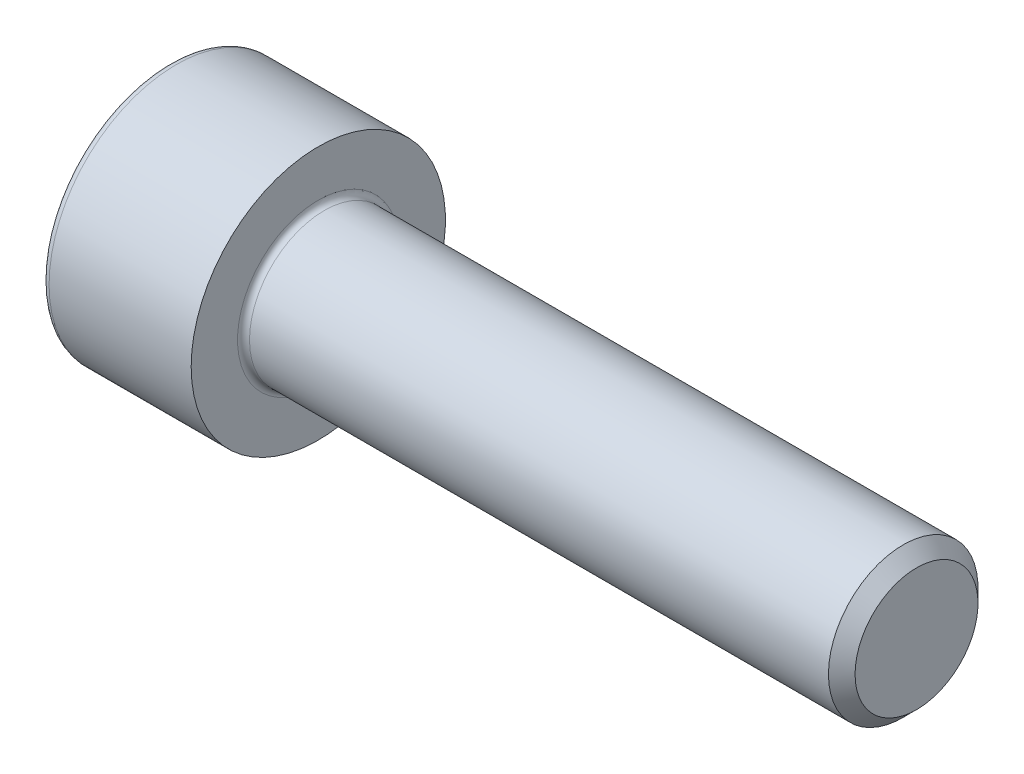
ISO-10303-21;
HEADER;
FILE_DESCRIPTION(('STEP AP214'),'2;1');
FILE_NAME('part.step','',(''),(''),'','','');
FILE_SCHEMA(('AUTOMOTIVE_DESIGN { 1 0 10303 214 1 1 1 1 }'));
ENDSEC;
DATA;
#1=APPLICATION_CONTEXT('core data for automotive mechanical design processes');
#2=APPLICATION_PROTOCOL_DEFINITION('international standard','automotive_design',2000,#1);
#3=PRODUCT_CONTEXT('',#1,'mechanical');
#4=PRODUCT('Part','Part','',(#3));
#5=PRODUCT_RELATED_PRODUCT_CATEGORY('part','',(#4));
#6=PRODUCT_DEFINITION_FORMATION('','',#4);
#7=PRODUCT_DEFINITION_CONTEXT('part definition',#1,'design');
#8=PRODUCT_DEFINITION('design','',#6,#7);
#9=PRODUCT_DEFINITION_SHAPE('','',#8);
#10=(LENGTH_UNIT() NAMED_UNIT(*) SI_UNIT(.MILLI.,.METRE.));
#11=(NAMED_UNIT(*) PLANE_ANGLE_UNIT() SI_UNIT($,.RADIAN.));
#12=(NAMED_UNIT(*) SI_UNIT($,.STERADIAN.) SOLID_ANGLE_UNIT());
#13=UNCERTAINTY_MEASURE_WITH_UNIT(LENGTH_MEASURE(1.E-05),#10,'distance_accuracy_value','');
#14=(GEOMETRIC_REPRESENTATION_CONTEXT(3) GLOBAL_UNCERTAINTY_ASSIGNED_CONTEXT((#13)) GLOBAL_UNIT_ASSIGNED_CONTEXT((#10,
#11,#12)) REPRESENTATION_CONTEXT('',''));
#15=CARTESIAN_POINT('',(0.,0.,0.));
#16=DIRECTION('',(0.,0.,1.));
#17=DIRECTION('',(1.,0.,0.));
#18=AXIS2_PLACEMENT_3D('',#15,#16,#17);
#19=CARTESIAN_POINT('',(0.,0.,0.));
#20=DIRECTION('',(-1.,0.,0.));
#21=DIRECTION('',(0.,0.,1.));
#22=AXIS2_PLACEMENT_3D('',#19,#20,#21);
#23=PLANE('',#22);
#24=DIRECTION('',(0.,-0.499999999999999,0.866025403784439));
#25=VECTOR('',#24,1.);
#26=CARTESIAN_POINT('',(0.,2.35789849937043,0.));
#27=LINE('',#26,#25);
#28=CARTESIAN_POINT('',(0.,2.35789849937043,0.));
#29=VERTEX_POINT('',#28);
#30=CARTESIAN_POINT('',(0.,1.17894924968522,2.042));
#31=VERTEX_POINT('',#30);
#32=EDGE_CURVE('E289',#29,#31,#27,.T.);
#33=ORIENTED_EDGE('',*,*,#32,.T.);
#34=DIRECTION('',(0.,1.,0.));
#35=VECTOR('',#34,1.);
#36=CARTESIAN_POINT('',(0.,-1.17894924968522,2.04200000000001));
#37=LINE('',#36,#35);
#38=CARTESIAN_POINT('',(0.,-1.17894924968522,2.04200000000001));
#39=VERTEX_POINT('',#38);
#40=EDGE_CURVE('E146',#39,#31,#37,.T.);
#41=ORIENTED_EDGE('',*,*,#40,.F.);
#42=DIRECTION('',(0.,-0.500000000000001,-0.866025403784438));
#43=VECTOR('',#42,1.);
#44=CARTESIAN_POINT('',(0.,-1.17894924968522,2.04200000000001));
#45=LINE('',#44,#43);
#46=CARTESIAN_POINT('',(0.,-2.35789849937043,0.));
#47=VERTEX_POINT('',#46);
#48=EDGE_CURVE('E294',#39,#47,#45,.T.);
#49=ORIENTED_EDGE('',*,*,#48,.T.);
#50=DIRECTION('',(0.,0.499999999999999,-0.866025403784439));
#51=VECTOR('',#50,1.);
#52=CARTESIAN_POINT('',(0.,-2.35789849937043,0.));
#53=LINE('',#52,#51);
#54=CARTESIAN_POINT('',(0.,-1.17894924968522,-2.042));
#55=VERTEX_POINT('',#54);
#56=EDGE_CURVE('E298',#47,#55,#53,.T.);
#57=ORIENTED_EDGE('',*,*,#56,.T.);
#58=DIRECTION('',(0.,-1.,0.));
#59=VECTOR('',#58,1.);
#60=CARTESIAN_POINT('',(0.,1.17894924968521,-2.042));
#61=LINE('',#60,#59);
#62=CARTESIAN_POINT('',(0.,1.17894924968521,-2.042));
#63=VERTEX_POINT('',#62);
#64=EDGE_CURVE('E302',#63,#55,#61,.T.);
#65=ORIENTED_EDGE('',*,*,#64,.F.);
#66=DIRECTION('',(0.,-0.500000000000001,-0.866025403784438));
#67=VECTOR('',#66,1.);
#68=CARTESIAN_POINT('',(0.,2.35789849937043,0.));
#69=LINE('',#68,#67);
#70=EDGE_CURVE('E141',#29,#63,#69,.T.);
#71=ORIENTED_EDGE('',*,*,#70,.F.);
#72=EDGE_LOOP('',(#33,#41,#49,#57,#65,#71));
#73=FACE_BOUND('',#72,.T.);
#74=CARTESIAN_POINT('',(0.,0.,0.));
#75=DIRECTION('',(-1.,0.,0.));
#76=DIRECTION('',(0.,0.,1.));
#77=AXIS2_PLACEMENT_3D('',#74,#75,#76);
#78=CIRCLE('',#77,4.);
#79=CARTESIAN_POINT('',(0.,0.,4.));
#80=VERTEX_POINT('',#79);
#81=EDGE_CURVE('E56',#80,#80,#78,.T.);
#82=ORIENTED_EDGE('',*,*,#81,.T.);
#83=EDGE_LOOP('',(#82));
#84=FACE_BOUND('',#83,.T.);
#85=ADVANCED_FACE('F47',(#73,#84),#23,.T.);
#86=CARTESIAN_POINT('',(-31.75,0.,0.));
#87=DIRECTION('',(-1.,0.,0.));
#88=DIRECTION('',(0.,0.,1.));
#89=AXIS2_PLACEMENT_3D('',#86,#87,#88);
#90=CYLINDRICAL_SURFACE('',#89,4.25);
#91=CARTESIAN_POINT('',(0.25,0.,0.));
#92=DIRECTION('',(-1.,0.,0.));
#93=DIRECTION('',(0.,0.,1.));
#94=AXIS2_PLACEMENT_3D('',#91,#92,#93);
#95=CIRCLE('',#94,4.25);
#96=CARTESIAN_POINT('',(0.25,0.,4.25));
#97=VERTEX_POINT('',#96);
#98=EDGE_CURVE('E11',#97,#97,#95,.F.);
#99=ORIENTED_EDGE('',*,*,#98,.T.);
#100=EDGE_LOOP('',(#99));
#101=FACE_BOUND('',#100,.T.);
#102=CARTESIAN_POINT('',(5.,0.,0.));
#103=DIRECTION('',(-1.,0.,0.));
#104=DIRECTION('',(0.,0.,1.));
#105=AXIS2_PLACEMENT_3D('',#102,#103,#104);
#106=CIRCLE('',#105,4.25);
#107=CARTESIAN_POINT('',(5.,0.,4.25));
#108=VERTEX_POINT('',#107);
#109=EDGE_CURVE('E170',#108,#108,#106,.T.);
#110=ORIENTED_EDGE('',*,*,#109,.T.);
#111=EDGE_LOOP('',(#110));
#112=FACE_BOUND('',#111,.T.);
#113=ADVANCED_FACE('F199',(#101,#112),#90,.T.);
#114=CARTESIAN_POINT('',(5.,4.25,0.));
#115=DIRECTION('',(1.,0.,0.));
#116=DIRECTION('',(0.,0.,-1.));
#117=AXIS2_PLACEMENT_3D('',#114,#115,#116);
#118=PLANE('',#117);
#119=CARTESIAN_POINT('',(5.,0.,0.));
#120=DIRECTION('',(1.,0.,0.));
#121=DIRECTION('',(0.,0.,-1.));
#122=AXIS2_PLACEMENT_3D('',#119,#120,#121);
#123=CIRCLE('',#122,2.7);
#124=CARTESIAN_POINT('',(5.,0.,-2.7));
#125=VERTEX_POINT('',#124);
#126=EDGE_CURVE('E174',#125,#125,#123,.F.);
#127=ORIENTED_EDGE('',*,*,#126,.T.);
#128=EDGE_LOOP('',(#127));
#129=FACE_BOUND('',#128,.T.);
#130=ORIENTED_EDGE('',*,*,#109,.F.);
#131=EDGE_LOOP('',(#130));
#132=FACE_BOUND('',#131,.T.);
#133=ADVANCED_FACE('F204',(#129,#132),#118,.T.);
#134=CARTESIAN_POINT('',(-31.75,0.,0.));
#135=DIRECTION('',(-1.,0.,0.));
#136=DIRECTION('',(0.,0.,1.));
#137=AXIS2_PLACEMENT_3D('',#134,#135,#136);
#138=CYLINDRICAL_SURFACE('',#137,2.5);
#139=CARTESIAN_POINT('',(5.2,0.,0.));
#140=DIRECTION('',(1.,0.,0.));
#141=DIRECTION('',(0.,0.,-1.));
#142=AXIS2_PLACEMENT_3D('',#139,#140,#141);
#143=CIRCLE('',#142,2.5);
#144=CARTESIAN_POINT('',(5.2,0.,-2.5));
#145=VERTEX_POINT('',#144);
#146=EDGE_CURVE('E178',#145,#145,#143,.T.);
#147=ORIENTED_EDGE('',*,*,#146,.T.);
#148=EDGE_LOOP('',(#147));
#149=FACE_BOUND('',#148,.T.);
#150=CARTESIAN_POINT('',(24.555,0.,0.));
#151=DIRECTION('',(-1.,0.,0.));
#152=DIRECTION('',(0.,0.,1.));
#153=AXIS2_PLACEMENT_3D('',#150,#151,#152);
#154=CIRCLE('',#153,2.5);
#155=CARTESIAN_POINT('',(24.555,0.,2.5));
#156=VERTEX_POINT('',#155);
#157=EDGE_CURVE('E166',#156,#156,#154,.T.);
#158=ORIENTED_EDGE('',*,*,#157,.T.);
#159=EDGE_LOOP('',(#158));
#160=FACE_BOUND('',#159,.T.);
#161=ADVANCED_FACE('F210',(#149,#160),#138,.T.);
#162=CARTESIAN_POINT('',(25.,0.,0.));
#163=DIRECTION('',(-1.,0.,0.));
#164=DIRECTION('',(0.,0.,1.));
#165=AXIS2_PLACEMENT_3D('',#162,#163,#164);
#166=CONICAL_SURFACE('',#165,2.055,0.785398163397471);
#167=ORIENTED_EDGE('',*,*,#157,.F.);
#168=EDGE_LOOP('',(#167));
#169=FACE_BOUND('',#168,.T.);
#170=CARTESIAN_POINT('',(25.,0.,0.));
#171=DIRECTION('',(-1.,0.,0.));
#172=DIRECTION('',(0.,0.,1.));
#173=AXIS2_PLACEMENT_3D('',#170,#171,#172);
#174=CIRCLE('',#173,2.055);
#175=CARTESIAN_POINT('',(25.,0.,2.055));
#176=VERTEX_POINT('',#175);
#177=EDGE_CURVE('E161',#176,#176,#174,.T.);
#178=ORIENTED_EDGE('',*,*,#177,.T.);
#179=EDGE_LOOP('',(#178));
#180=FACE_BOUND('',#179,.T.);
#181=ADVANCED_FACE('F214',(#169,#180),#166,.T.);
#182=CARTESIAN_POINT('',(25.,2.055,0.));
#183=DIRECTION('',(1.,0.,0.));
#184=DIRECTION('',(0.,0.,-1.));
#185=AXIS2_PLACEMENT_3D('',#182,#183,#184);
#186=PLANE('',#185);
#187=ORIENTED_EDGE('',*,*,#177,.F.);
#188=EDGE_LOOP('',(#187));
#189=FACE_BOUND('',#188,.T.);
#190=ADVANCED_FACE('F196',(#189),#186,.T.);
#191=CARTESIAN_POINT('',(5.2,0.,0.));
#192=DIRECTION('',(1.,0.,0.));
#193=DIRECTION('',(0.,0.,-1.));
#194=AXIS2_PLACEMENT_3D('',#191,#192,#193);
#195=TOROIDAL_SURFACE('',#194,2.7,0.2);
#196=ORIENTED_EDGE('',*,*,#146,.F.);
#197=EDGE_LOOP('',(#196));
#198=FACE_BOUND('',#197,.T.);
#199=ORIENTED_EDGE('',*,*,#126,.F.);
#200=EDGE_LOOP('',(#199));
#201=FACE_BOUND('',#200,.T.);
#202=ADVANCED_FACE('F187',(#198,#201),#195,.F.);
#203=CARTESIAN_POINT('',(0.25,0.,0.));
#204=DIRECTION('',(-1.,0.,0.));
#205=DIRECTION('',(0.,0.,1.));
#206=AXIS2_PLACEMENT_3D('',#203,#204,#205);
#207=TOROIDAL_SURFACE('',#206,4.,0.25);
#208=ORIENTED_EDGE('',*,*,#98,.F.);
#209=EDGE_LOOP('',(#208));
#210=FACE_BOUND('',#209,.T.);
#211=ORIENTED_EDGE('',*,*,#81,.F.);
#212=EDGE_LOOP('',(#211));
#213=FACE_BOUND('',#212,.T.);
#214=ADVANCED_FACE('F49',(#210,#213),#207,.T.);
#215=CARTESIAN_POINT('',(2.5,2.35789849937043,0.));
#216=DIRECTION('',(0.,-0.866025403784439,-0.499999999999999));
#217=DIRECTION('',(0.,0.499999999999999,-0.866025403784439));
#218=AXIS2_PLACEMENT_3D('',#215,#216,#217);
#219=PLANE('',#218);
#220=ORIENTED_EDGE('',*,*,#32,.F.);
#221=DIRECTION('',(-1.,0.,0.));
#222=VECTOR('',#221,1.);
#223=CARTESIAN_POINT('',(2.5,2.35789849937043,0.));
#224=LINE('',#223,#222);
#225=CARTESIAN_POINT('',(2.5,2.35789849937043,0.));
#226=VERTEX_POINT('',#225);
#227=EDGE_CURVE('E276',#226,#29,#224,.T.);
#228=ORIENTED_EDGE('',*,*,#227,.F.);
#229=DIRECTION('',(0.,-0.499999999999999,0.866025403784439));
#230=VECTOR('',#229,1.);
#231=CARTESIAN_POINT('',(2.5,2.35789849937043,0.));
#232=LINE('',#231,#230);
#233=CARTESIAN_POINT('',(2.5,1.76842387452783,1.021));
#234=VERTEX_POINT('',#233);
#235=EDGE_CURVE('E132',#226,#234,#232,.T.);
#236=ORIENTED_EDGE('',*,*,#235,.T.);
#237=CARTESIAN_POINT('',(2.5,1.17894924968522,2.042));
#238=VERTEX_POINT('',#237);
#239=EDGE_CURVE('E122',#234,#238,#232,.T.);
#240=ORIENTED_EDGE('',*,*,#239,.T.);
#241=DIRECTION('',(-1.,0.,0.));
#242=VECTOR('',#241,1.);
#243=CARTESIAN_POINT('',(2.5,1.17894924968522,2.042));
#244=LINE('',#243,#242);
#245=EDGE_CURVE('E137',#238,#31,#244,.T.);
#246=ORIENTED_EDGE('',*,*,#245,.T.);
#247=EDGE_LOOP('',(#220,#228,#236,#240,#246));
#248=FACE_BOUND('',#247,.T.);
#249=ADVANCED_FACE('F136',(#248),#219,.T.);
#250=CARTESIAN_POINT('',(2.5,-1.17894924968522,2.04200000000001));
#251=DIRECTION('',(0.,0.,1.));
#252=DIRECTION('',(0.,-1.,0.));
#253=AXIS2_PLACEMENT_3D('',#250,#251,#252);
#254=PLANE('',#253);
#255=ORIENTED_EDGE('',*,*,#40,.T.);
#256=ORIENTED_EDGE('',*,*,#245,.F.);
#257=DIRECTION('',(0.,1.,0.));
#258=VECTOR('',#257,1.);
#259=CARTESIAN_POINT('',(2.5,-1.17894924968522,2.04200000000001));
#260=LINE('',#259,#258);
#261=CARTESIAN_POINT('',(2.5,0.,2.042));
#262=VERTEX_POINT('',#261);
#263=EDGE_CURVE('E119',#262,#238,#260,.T.);
#264=ORIENTED_EDGE('',*,*,#263,.F.);
#265=CARTESIAN_POINT('',(2.5,-1.17894924968522,2.04200000000001));
#266=VERTEX_POINT('',#265);
#267=EDGE_CURVE('E131',#266,#262,#260,.T.);
#268=ORIENTED_EDGE('',*,*,#267,.F.);
#269=DIRECTION('',(-1.,0.,0.));
#270=VECTOR('',#269,1.);
#271=CARTESIAN_POINT('',(2.5,-1.17894924968522,2.04200000000001));
#272=LINE('',#271,#270);
#273=EDGE_CURVE('E149',#266,#39,#272,.T.);
#274=ORIENTED_EDGE('',*,*,#273,.T.);
#275=EDGE_LOOP('',(#255,#256,#264,#268,#274));
#276=FACE_BOUND('',#275,.T.);
#277=ADVANCED_FACE('F143',(#276),#254,.F.);
#278=CARTESIAN_POINT('',(2.5,-1.17894924968522,2.04200000000001));
#279=DIRECTION('',(0.,0.866025403784438,-0.500000000000001));
#280=DIRECTION('',(0.,0.500000000000001,0.866025403784438));
#281=AXIS2_PLACEMENT_3D('',#278,#279,#280);
#282=PLANE('',#281);
#283=ORIENTED_EDGE('',*,*,#48,.F.);
#284=ORIENTED_EDGE('',*,*,#273,.F.);
#285=DIRECTION('',(0.,-0.500000000000001,-0.866025403784438));
#286=VECTOR('',#285,1.);
#287=CARTESIAN_POINT('',(2.5,-1.17894924968522,2.04200000000001));
#288=LINE('',#287,#286);
#289=CARTESIAN_POINT('',(2.5,-1.76842387452783,1.021));
#290=VERTEX_POINT('',#289);
#291=EDGE_CURVE('E332',#266,#290,#288,.T.);
#292=ORIENTED_EDGE('',*,*,#291,.T.);
#293=CARTESIAN_POINT('',(2.5,-2.35789849937043,0.));
#294=VERTEX_POINT('',#293);
#295=EDGE_CURVE('E316',#290,#294,#288,.T.);
#296=ORIENTED_EDGE('',*,*,#295,.T.);
#297=DIRECTION('',(-1.,0.,0.));
#298=VECTOR('',#297,1.);
#299=CARTESIAN_POINT('',(2.5,-2.35789849937043,0.));
#300=LINE('',#299,#298);
#301=EDGE_CURVE('E156',#294,#47,#300,.T.);
#302=ORIENTED_EDGE('',*,*,#301,.T.);
#303=EDGE_LOOP('',(#283,#284,#292,#296,#302));
#304=FACE_BOUND('',#303,.T.);
#305=ADVANCED_FACE('F228',(#304),#282,.T.);
#306=CARTESIAN_POINT('',(2.5,-2.35789849937043,0.));
#307=DIRECTION('',(0.,0.866025403784439,0.499999999999999));
#308=DIRECTION('',(0.,-0.499999999999999,0.866025403784439));
#309=AXIS2_PLACEMENT_3D('',#306,#307,#308);
#310=PLANE('',#309);
#311=ORIENTED_EDGE('',*,*,#56,.F.);
#312=ORIENTED_EDGE('',*,*,#301,.F.);
#313=DIRECTION('',(0.,0.499999999999999,-0.866025403784439));
#314=VECTOR('',#313,1.);
#315=CARTESIAN_POINT('',(2.5,-2.35789849937043,0.));
#316=LINE('',#315,#314);
#317=CARTESIAN_POINT('',(2.5,-1.76842387452783,-1.021));
#318=VERTEX_POINT('',#317);
#319=EDGE_CURVE('E284',#294,#318,#316,.T.);
#320=ORIENTED_EDGE('',*,*,#319,.T.);
#321=CARTESIAN_POINT('',(2.5,-1.17894924968522,-2.042));
#322=VERTEX_POINT('',#321);
#323=EDGE_CURVE('E330',#318,#322,#316,.T.);
#324=ORIENTED_EDGE('',*,*,#323,.T.);
#325=DIRECTION('',(-1.,0.,0.));
#326=VECTOR('',#325,1.);
#327=CARTESIAN_POINT('',(2.5,-1.17894924968522,-2.042));
#328=LINE('',#327,#326);
#329=EDGE_CURVE('E275',#322,#55,#328,.T.);
#330=ORIENTED_EDGE('',*,*,#329,.T.);
#331=EDGE_LOOP('',(#311,#312,#320,#324,#330));
#332=FACE_BOUND('',#331,.T.);
#333=ADVANCED_FACE('F231',(#332),#310,.T.);
#334=CARTESIAN_POINT('',(2.5,1.17894924968521,-2.042));
#335=DIRECTION('',(0.,0.,-1.));
#336=DIRECTION('',(0.,1.,0.));
#337=AXIS2_PLACEMENT_3D('',#334,#335,#336);
#338=PLANE('',#337);
#339=ORIENTED_EDGE('',*,*,#64,.T.);
#340=ORIENTED_EDGE('',*,*,#329,.F.);
#341=DIRECTION('',(0.,-1.,0.));
#342=VECTOR('',#341,1.);
#343=CARTESIAN_POINT('',(2.5,1.17894924968521,-2.042));
#344=LINE('',#343,#342);
#345=CARTESIAN_POINT('',(2.5,0.,-2.042));
#346=VERTEX_POINT('',#345);
#347=EDGE_CURVE('E279',#346,#322,#344,.T.);
#348=ORIENTED_EDGE('',*,*,#347,.F.);
#349=CARTESIAN_POINT('',(2.5,1.17894924968521,-2.042));
#350=VERTEX_POINT('',#349);
#351=EDGE_CURVE('E63',#350,#346,#344,.T.);
#352=ORIENTED_EDGE('',*,*,#351,.F.);
#353=DIRECTION('',(-1.,0.,0.));
#354=VECTOR('',#353,1.);
#355=CARTESIAN_POINT('',(2.5,1.17894924968521,-2.042));
#356=LINE('',#355,#354);
#357=EDGE_CURVE('E271',#350,#63,#356,.T.);
#358=ORIENTED_EDGE('',*,*,#357,.T.);
#359=EDGE_LOOP('',(#339,#340,#348,#352,#358));
#360=FACE_BOUND('',#359,.T.);
#361=ADVANCED_FACE('F235',(#360),#338,.F.);
#362=CARTESIAN_POINT('',(2.5,2.35789849937043,0.));
#363=DIRECTION('',(0.,0.866025403784438,-0.500000000000001));
#364=DIRECTION('',(0.,0.500000000000001,0.866025403784438));
#365=AXIS2_PLACEMENT_3D('',#362,#363,#364);
#366=PLANE('',#365);
#367=ORIENTED_EDGE('',*,*,#70,.T.);
#368=ORIENTED_EDGE('',*,*,#357,.F.);
#369=DIRECTION('',(0.,-0.500000000000001,-0.866025403784438));
#370=VECTOR('',#369,1.);
#371=CARTESIAN_POINT('',(2.5,2.35789849937043,0.));
#372=LINE('',#371,#370);
#373=CARTESIAN_POINT('',(2.5,1.76842387452782,-1.021));
#374=VERTEX_POINT('',#373);
#375=EDGE_CURVE('E260',#374,#350,#372,.T.);
#376=ORIENTED_EDGE('',*,*,#375,.F.);
#377=EDGE_CURVE('E267',#226,#374,#372,.T.);
#378=ORIENTED_EDGE('',*,*,#377,.F.);
#379=ORIENTED_EDGE('',*,*,#227,.T.);
#380=EDGE_LOOP('',(#367,#368,#376,#378,#379));
#381=FACE_BOUND('',#380,.T.);
#382=ADVANCED_FACE('F239',(#381),#366,.F.);
#383=CARTESIAN_POINT('',(2.5,2.35789849937043,0.));
#384=DIRECTION('',(1.,0.,0.));
#385=DIRECTION('',(0.,0.,-1.));
#386=AXIS2_PLACEMENT_3D('',#383,#384,#385);
#387=PLANE('',#386);
#388=ORIENTED_EDGE('',*,*,#347,.T.);
#389=ORIENTED_EDGE('',*,*,#323,.F.);
#390=CARTESIAN_POINT('',(2.5,0.,0.));
#391=DIRECTION('',(-1.,0.,0.));
#392=DIRECTION('',(0.,0.,1.));
#393=AXIS2_PLACEMENT_3D('',#390,#391,#392);
#394=CIRCLE('',#393,2.042);
#395=EDGE_CURVE('E324',#346,#318,#394,.T.);
#396=ORIENTED_EDGE('',*,*,#395,.F.);
#397=EDGE_LOOP('',(#388,#389,#396));
#398=FACE_BOUND('',#397,.T.);
#399=ADVANCED_FACE('F243',(#398),#387,.F.);
#400=ORIENTED_EDGE('',*,*,#319,.F.);
#401=ORIENTED_EDGE('',*,*,#295,.F.);
#402=EDGE_CURVE('E154',#318,#290,#394,.T.);
#403=ORIENTED_EDGE('',*,*,#402,.F.);
#404=EDGE_LOOP('',(#400,#401,#403));
#405=FACE_BOUND('',#404,.T.);
#406=ADVANCED_FACE('F246',(#405),#387,.F.);
#407=ORIENTED_EDGE('',*,*,#291,.F.);
#408=ORIENTED_EDGE('',*,*,#267,.T.);
#409=EDGE_CURVE('E148',#290,#262,#394,.T.);
#410=ORIENTED_EDGE('',*,*,#409,.F.);
#411=EDGE_LOOP('',(#407,#408,#410));
#412=FACE_BOUND('',#411,.T.);
#413=ADVANCED_FACE('F251',(#412),#387,.F.);
#414=ORIENTED_EDGE('',*,*,#263,.T.);
#415=ORIENTED_EDGE('',*,*,#239,.F.);
#416=EDGE_CURVE('E125',#262,#234,#394,.T.);
#417=ORIENTED_EDGE('',*,*,#416,.F.);
#418=EDGE_LOOP('',(#414,#415,#417));
#419=FACE_BOUND('',#418,.T.);
#420=ADVANCED_FACE('F121',(#419),#387,.F.);
#421=ORIENTED_EDGE('',*,*,#235,.F.);
#422=ORIENTED_EDGE('',*,*,#377,.T.);
#423=EDGE_CURVE('E162',#234,#374,#394,.T.);
#424=ORIENTED_EDGE('',*,*,#423,.F.);
#425=EDGE_LOOP('',(#421,#422,#424));
#426=FACE_BOUND('',#425,.T.);
#427=ADVANCED_FACE('F254',(#426),#387,.F.);
#428=ORIENTED_EDGE('',*,*,#375,.T.);
#429=ORIENTED_EDGE('',*,*,#351,.T.);
#430=EDGE_CURVE('E263',#374,#346,#394,.T.);
#431=ORIENTED_EDGE('',*,*,#430,.F.);
#432=EDGE_LOOP('',(#428,#429,#431));
#433=FACE_BOUND('',#432,.T.);
#434=ADVANCED_FACE('F224',(#433),#387,.F.);
#435=CARTESIAN_POINT('',(2.5,0.,0.));
#436=DIRECTION('',(-1.,0.,0.));
#437=DIRECTION('',(0.,0.,1.));
#438=AXIS2_PLACEMENT_3D('',#435,#436,#437);
#439=CONICAL_SURFACE('',#438,2.042,1.04719755119659);
#440=CARTESIAN_POINT('',(3.67894924968523,0.,0.));
#441=VERTEX_POINT('',#440);
#442=VERTEX_LOOP('',#441);
#443=FACE_BOUND('',#442,.T.);
#444=ORIENTED_EDGE('',*,*,#416,.T.);
#445=ORIENTED_EDGE('',*,*,#423,.T.);
#446=ORIENTED_EDGE('',*,*,#430,.T.);
#447=ORIENTED_EDGE('',*,*,#395,.T.);
#448=ORIENTED_EDGE('',*,*,#402,.T.);
#449=ORIENTED_EDGE('',*,*,#409,.T.);
#450=EDGE_LOOP('',(#444,#445,#446,#447,#448,#449));
#451=FACE_BOUND('',#450,.T.);
#452=ADVANCED_FACE('F222',(#443,#451),#439,.F.);
#453=CLOSED_SHELL('',(#85,#113,#133,#161,#181,#190,#202,#214,#249,#277,#305,#333,#361,#382,#399,
#406,#413,#420,#427,#434,#452));
#454=MANIFOLD_SOLID_BREP('B2',#453);
#455=ADVANCED_BREP_SHAPE_REPRESENTATION('',(#18,#454),#14);
#456=SHAPE_DEFINITION_REPRESENTATION(#9,#455);
ENDSEC;
END-ISO-10303-21;
